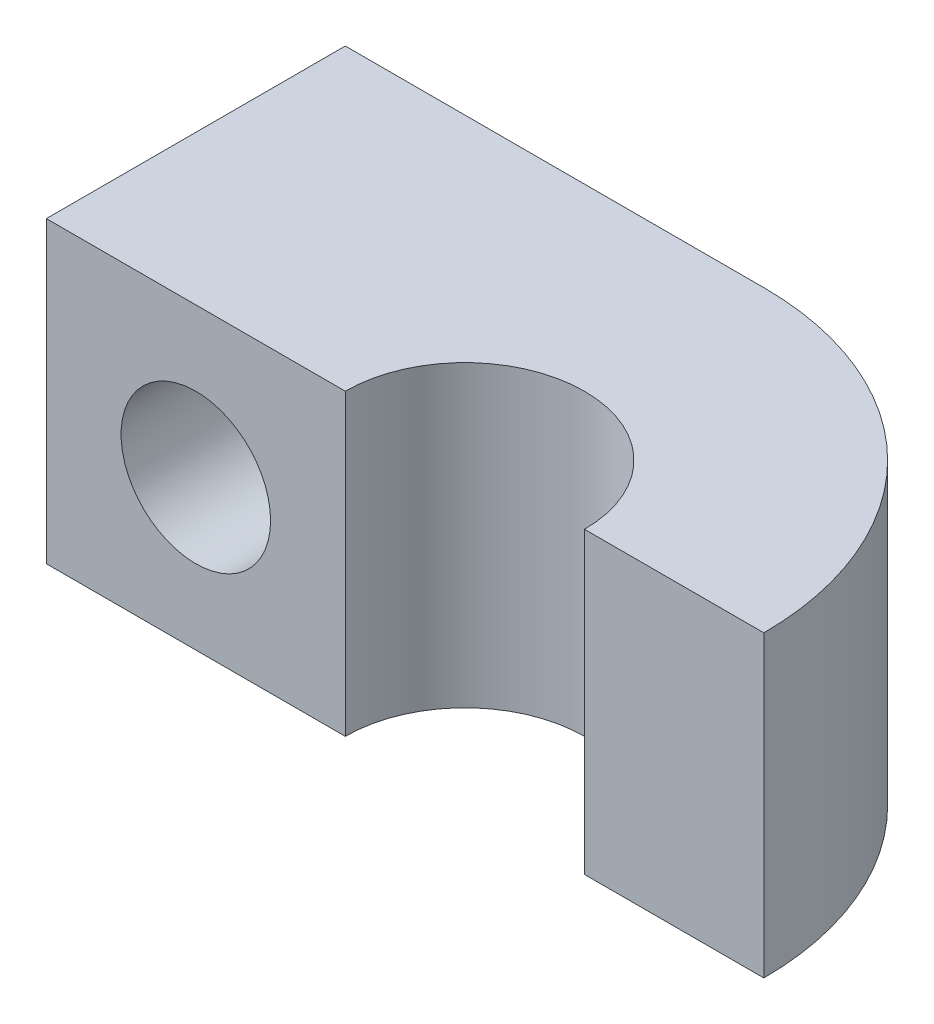
ISO-10303-21;
HEADER;
FILE_DESCRIPTION(('STEP AP214'),'2;1');
FILE_NAME('part.step','',(''),(''),'','','');
FILE_SCHEMA(('AUTOMOTIVE_DESIGN { 1 0 10303 214 1 1 1 1 }'));
ENDSEC;
DATA;
#1=APPLICATION_CONTEXT('core data for automotive mechanical design processes');
#2=APPLICATION_PROTOCOL_DEFINITION('international standard','automotive_design',2000,#1);
#3=PRODUCT_CONTEXT('',#1,'mechanical');
#4=PRODUCT('Part','Part','',(#3));
#5=PRODUCT_RELATED_PRODUCT_CATEGORY('part','',(#4));
#6=PRODUCT_DEFINITION_FORMATION('','',#4);
#7=PRODUCT_DEFINITION_CONTEXT('part definition',#1,'design');
#8=PRODUCT_DEFINITION('design','',#6,#7);
#9=PRODUCT_DEFINITION_SHAPE('','',#8);
#10=(LENGTH_UNIT() NAMED_UNIT(*) SI_UNIT(.MILLI.,.METRE.));
#11=(NAMED_UNIT(*) PLANE_ANGLE_UNIT() SI_UNIT($,.RADIAN.));
#12=(NAMED_UNIT(*) SI_UNIT($,.STERADIAN.) SOLID_ANGLE_UNIT());
#13=UNCERTAINTY_MEASURE_WITH_UNIT(LENGTH_MEASURE(1.E-05),#10,'distance_accuracy_value','');
#14=(GEOMETRIC_REPRESENTATION_CONTEXT(3) GLOBAL_UNCERTAINTY_ASSIGNED_CONTEXT((#13)) GLOBAL_UNIT_ASSIGNED_CONTEXT((#10,
#11,#12)) REPRESENTATION_CONTEXT('',''));
#15=CARTESIAN_POINT('',(0.,0.,0.));
#16=DIRECTION('',(0.,0.,1.));
#17=DIRECTION('',(1.,0.,0.));
#18=AXIS2_PLACEMENT_3D('',#15,#16,#17);
#19=CARTESIAN_POINT('',(0.,5.,0.));
#20=DIRECTION('',(0.,-1.,0.));
#21=DIRECTION('',(0.,0.,-1.));
#22=AXIS2_PLACEMENT_3D('',#19,#20,#21);
#23=CYLINDRICAL_SURFACE('',#22,2.);
#24=CARTESIAN_POINT('',(0.,0.,0.));
#25=DIRECTION('',(0.,-1.,0.));
#26=DIRECTION('',(0.,0.,1.));
#27=AXIS2_PLACEMENT_3D('',#24,#25,#26);
#28=CIRCLE('',#27,2.);
#29=CARTESIAN_POINT('',(-2.,0.,0.));
#30=VERTEX_POINT('',#29);
#31=CARTESIAN_POINT('',(2.,0.,0.));
#32=VERTEX_POINT('',#31);
#33=EDGE_CURVE('E125',#30,#32,#28,.T.);
#34=ORIENTED_EDGE('',*,*,#33,.T.);
#35=DIRECTION('',(0.,-1.,0.));
#36=VECTOR('',#35,1.);
#37=CARTESIAN_POINT('',(2.,5.,0.));
#38=LINE('',#37,#36);
#39=CARTESIAN_POINT('',(2.,5.,0.));
#40=VERTEX_POINT('',#39);
#41=EDGE_CURVE('E11',#40,#32,#38,.T.);
#42=ORIENTED_EDGE('',*,*,#41,.F.);
#43=CARTESIAN_POINT('',(0.,5.,0.));
#44=DIRECTION('',(0.,-1.,0.));
#45=DIRECTION('',(0.,0.,1.));
#46=AXIS2_PLACEMENT_3D('',#43,#44,#45);
#47=CIRCLE('',#46,2.);
#48=CARTESIAN_POINT('',(-2.,5.,0.));
#49=VERTEX_POINT('',#48);
#50=EDGE_CURVE('E136',#49,#40,#47,.T.);
#51=ORIENTED_EDGE('',*,*,#50,.F.);
#52=DIRECTION('',(0.,-1.,0.));
#53=VECTOR('',#52,1.);
#54=CARTESIAN_POINT('',(-2.,5.,0.));
#55=LINE('',#54,#53);
#56=EDGE_CURVE('E121',#49,#30,#55,.T.);
#57=ORIENTED_EDGE('',*,*,#56,.T.);
#58=EDGE_LOOP('',(#34,#42,#51,#57));
#59=FACE_BOUND('',#58,.T.);
#60=ADVANCED_FACE('F41',(#59),#23,.F.);
#61=CARTESIAN_POINT('',(2.,5.,0.));
#62=DIRECTION('',(0.,0.,-1.));
#63=DIRECTION('',(-1.,0.,0.));
#64=AXIS2_PLACEMENT_3D('',#61,#62,#63);
#65=PLANE('',#64);
#66=DIRECTION('',(1.,0.,0.));
#67=VECTOR('',#66,1.);
#68=CARTESIAN_POINT('',(2.,0.,0.));
#69=LINE('',#68,#67);
#70=CARTESIAN_POINT('',(5.,0.,0.));
#71=VERTEX_POINT('',#70);
#72=EDGE_CURVE('E128',#32,#71,#69,.T.);
#73=ORIENTED_EDGE('',*,*,#72,.T.);
#74=DIRECTION('',(0.,-1.,0.));
#75=VECTOR('',#74,1.);
#76=CARTESIAN_POINT('',(5.,5.,0.));
#77=LINE('',#76,#75);
#78=CARTESIAN_POINT('',(5.,5.,0.));
#79=VERTEX_POINT('',#78);
#80=EDGE_CURVE('E49',#79,#71,#77,.T.);
#81=ORIENTED_EDGE('',*,*,#80,.F.);
#82=DIRECTION('',(1.,0.,0.));
#83=VECTOR('',#82,1.);
#84=CARTESIAN_POINT('',(2.,5.,0.));
#85=LINE('',#84,#83);
#86=EDGE_CURVE('E94',#40,#79,#85,.T.);
#87=ORIENTED_EDGE('',*,*,#86,.F.);
#88=ORIENTED_EDGE('',*,*,#41,.T.);
#89=EDGE_LOOP('',(#73,#81,#87,#88));
#90=FACE_BOUND('',#89,.T.);
#91=ADVANCED_FACE('F164',(#90),#65,.F.);
#92=CARTESIAN_POINT('',(0.,5.,0.));
#93=DIRECTION('',(0.,-1.,0.));
#94=DIRECTION('',(0.,0.,-1.));
#95=AXIS2_PLACEMENT_3D('',#92,#93,#94);
#96=CYLINDRICAL_SURFACE('',#95,5.);
#97=CARTESIAN_POINT('',(0.,0.,0.));
#98=DIRECTION('',(0.,1.,0.));
#99=DIRECTION('',(0.,0.,1.));
#100=AXIS2_PLACEMENT_3D('',#97,#98,#99);
#101=CIRCLE('',#100,5.);
#102=CARTESIAN_POINT('',(0.,0.,-5.));
#103=VERTEX_POINT('',#102);
#104=EDGE_CURVE('E131',#71,#103,#101,.T.);
#105=ORIENTED_EDGE('',*,*,#104,.T.);
#106=DIRECTION('',(0.,-1.,0.));
#107=VECTOR('',#106,1.);
#108=CARTESIAN_POINT('',(0.,5.,-5.));
#109=LINE('',#108,#107);
#110=CARTESIAN_POINT('',(0.,5.,-5.));
#111=VERTEX_POINT('',#110);
#112=EDGE_CURVE('E116',#111,#103,#109,.T.);
#113=ORIENTED_EDGE('',*,*,#112,.F.);
#114=CARTESIAN_POINT('',(0.,5.,0.));
#115=DIRECTION('',(0.,1.,0.));
#116=DIRECTION('',(0.,0.,1.));
#117=AXIS2_PLACEMENT_3D('',#114,#115,#116);
#118=CIRCLE('',#117,5.);
#119=EDGE_CURVE('E107',#79,#111,#118,.T.);
#120=ORIENTED_EDGE('',*,*,#119,.F.);
#121=ORIENTED_EDGE('',*,*,#80,.T.);
#122=EDGE_LOOP('',(#105,#113,#120,#121));
#123=FACE_BOUND('',#122,.T.);
#124=ADVANCED_FACE('F142',(#123),#96,.T.);
#125=CARTESIAN_POINT('',(-7.,5.,-5.));
#126=DIRECTION('',(0.,0.,1.));
#127=DIRECTION('',(1.,0.,0.));
#128=AXIS2_PLACEMENT_3D('',#125,#126,#127);
#129=PLANE('',#128);
#130=CARTESIAN_POINT('',(-4.5,2.5,-5.));
#131=DIRECTION('',(0.,0.,1.));
#132=DIRECTION('',(1.,0.,0.));
#133=AXIS2_PLACEMENT_3D('',#130,#131,#132);
#134=CIRCLE('',#133,1.25);
#135=CARTESIAN_POINT('',(-3.25,2.5,-5.));
#136=VERTEX_POINT('',#135);
#137=EDGE_CURVE('E129',#136,#136,#134,.T.);
#138=ORIENTED_EDGE('',*,*,#137,.T.);
#139=EDGE_LOOP('',(#138));
#140=FACE_BOUND('',#139,.T.);
#141=DIRECTION('',(-1.,0.,0.));
#142=VECTOR('',#141,1.);
#143=CARTESIAN_POINT('',(-7.,0.,-5.));
#144=LINE('',#143,#142);
#145=CARTESIAN_POINT('',(-7.,0.,-5.));
#146=VERTEX_POINT('',#145);
#147=EDGE_CURVE('E115',#103,#146,#144,.T.);
#148=ORIENTED_EDGE('',*,*,#147,.T.);
#149=DIRECTION('',(0.,-1.,0.));
#150=VECTOR('',#149,1.);
#151=CARTESIAN_POINT('',(-7.,5.,-5.));
#152=LINE('',#151,#150);
#153=CARTESIAN_POINT('',(-7.,5.,-5.));
#154=VERTEX_POINT('',#153);
#155=EDGE_CURVE('E112',#154,#146,#152,.T.);
#156=ORIENTED_EDGE('',*,*,#155,.F.);
#157=DIRECTION('',(-1.,0.,0.));
#158=VECTOR('',#157,1.);
#159=CARTESIAN_POINT('',(-7.,5.,-5.));
#160=LINE('',#159,#158);
#161=EDGE_CURVE('E101',#111,#154,#160,.T.);
#162=ORIENTED_EDGE('',*,*,#161,.F.);
#163=ORIENTED_EDGE('',*,*,#112,.T.);
#164=EDGE_LOOP('',(#148,#156,#162,#163));
#165=FACE_BOUND('',#164,.T.);
#166=ADVANCED_FACE('F113',(#140,#165),#129,.F.);
#167=CARTESIAN_POINT('',(-7.,5.,0.));
#168=DIRECTION('',(1.,0.,0.));
#169=DIRECTION('',(0.,0.,-1.));
#170=AXIS2_PLACEMENT_3D('',#167,#168,#169);
#171=PLANE('',#170);
#172=DIRECTION('',(0.,0.,1.));
#173=VECTOR('',#172,1.);
#174=CARTESIAN_POINT('',(-7.,0.,0.));
#175=LINE('',#174,#173);
#176=CARTESIAN_POINT('',(-7.,0.,0.));
#177=VERTEX_POINT('',#176);
#178=EDGE_CURVE('E80',#146,#177,#175,.T.);
#179=ORIENTED_EDGE('',*,*,#178,.T.);
#180=DIRECTION('',(0.,-1.,0.));
#181=VECTOR('',#180,1.);
#182=CARTESIAN_POINT('',(-7.,5.,0.));
#183=LINE('',#182,#181);
#184=CARTESIAN_POINT('',(-7.,5.,0.));
#185=VERTEX_POINT('',#184);
#186=EDGE_CURVE('E117',#185,#177,#183,.T.);
#187=ORIENTED_EDGE('',*,*,#186,.F.);
#188=DIRECTION('',(0.,0.,1.));
#189=VECTOR('',#188,1.);
#190=CARTESIAN_POINT('',(-7.,5.,0.));
#191=LINE('',#190,#189);
#192=EDGE_CURVE('E105',#154,#185,#191,.T.);
#193=ORIENTED_EDGE('',*,*,#192,.F.);
#194=ORIENTED_EDGE('',*,*,#155,.T.);
#195=EDGE_LOOP('',(#179,#187,#193,#194));
#196=FACE_BOUND('',#195,.T.);
#197=ADVANCED_FACE('F119',(#196),#171,.F.);
#198=CARTESIAN_POINT('',(-2.,5.,0.));
#199=DIRECTION('',(0.,0.,-1.));
#200=DIRECTION('',(-1.,0.,0.));
#201=AXIS2_PLACEMENT_3D('',#198,#199,#200);
#202=PLANE('',#201);
#203=CARTESIAN_POINT('',(-4.5,2.5,0.));
#204=DIRECTION('',(0.,0.,1.));
#205=DIRECTION('',(1.,0.,0.));
#206=AXIS2_PLACEMENT_3D('',#203,#204,#205);
#207=CIRCLE('',#206,1.25);
#208=CARTESIAN_POINT('',(-3.25,2.5,0.));
#209=VERTEX_POINT('',#208);
#210=EDGE_CURVE('E180',#209,#209,#207,.T.);
#211=ORIENTED_EDGE('',*,*,#210,.F.);
#212=EDGE_LOOP('',(#211));
#213=FACE_BOUND('',#212,.T.);
#214=DIRECTION('',(1.,0.,0.));
#215=VECTOR('',#214,1.);
#216=CARTESIAN_POINT('',(-2.,0.,0.));
#217=LINE('',#216,#215);
#218=EDGE_CURVE('E86',#177,#30,#217,.T.);
#219=ORIENTED_EDGE('',*,*,#218,.T.);
#220=ORIENTED_EDGE('',*,*,#56,.F.);
#221=DIRECTION('',(1.,0.,0.));
#222=VECTOR('',#221,1.);
#223=CARTESIAN_POINT('',(-2.,5.,0.));
#224=LINE('',#223,#222);
#225=EDGE_CURVE('E57',#185,#49,#224,.T.);
#226=ORIENTED_EDGE('',*,*,#225,.F.);
#227=ORIENTED_EDGE('',*,*,#186,.T.);
#228=EDGE_LOOP('',(#219,#220,#226,#227));
#229=FACE_BOUND('',#228,.T.);
#230=ADVANCED_FACE('F149',(#213,#229),#202,.F.);
#231=CARTESIAN_POINT('',(0.,5.,0.));
#232=DIRECTION('',(0.,1.,0.));
#233=DIRECTION('',(0.,0.,1.));
#234=AXIS2_PLACEMENT_3D('',#231,#232,#233);
#235=PLANE('',#234);
#236=ORIENTED_EDGE('',*,*,#50,.T.);
#237=ORIENTED_EDGE('',*,*,#86,.T.);
#238=ORIENTED_EDGE('',*,*,#119,.T.);
#239=ORIENTED_EDGE('',*,*,#161,.T.);
#240=ORIENTED_EDGE('',*,*,#192,.T.);
#241=ORIENTED_EDGE('',*,*,#225,.T.);
#242=EDGE_LOOP('',(#236,#237,#238,#239,#240,#241));
#243=FACE_BOUND('',#242,.T.);
#244=ADVANCED_FACE('F103',(#243),#235,.T.);
#245=CARTESIAN_POINT('',(0.,0.,0.));
#246=DIRECTION('',(0.,1.,0.));
#247=DIRECTION('',(0.,0.,1.));
#248=AXIS2_PLACEMENT_3D('',#245,#246,#247);
#249=PLANE('',#248);
#250=ORIENTED_EDGE('',*,*,#33,.F.);
#251=ORIENTED_EDGE('',*,*,#218,.F.);
#252=ORIENTED_EDGE('',*,*,#178,.F.);
#253=ORIENTED_EDGE('',*,*,#147,.F.);
#254=ORIENTED_EDGE('',*,*,#104,.F.);
#255=ORIENTED_EDGE('',*,*,#72,.F.);
#256=EDGE_LOOP('',(#250,#251,#252,#253,#254,#255));
#257=FACE_BOUND('',#256,.T.);
#258=ADVANCED_FACE('F145',(#257),#249,.F.);
#259=CARTESIAN_POINT('',(-4.5,2.5,-5.));
#260=DIRECTION('',(0.,0.,1.));
#261=DIRECTION('',(1.,0.,0.));
#262=AXIS2_PLACEMENT_3D('',#259,#260,#261);
#263=CYLINDRICAL_SURFACE('',#262,1.25);
#264=ORIENTED_EDGE('',*,*,#137,.F.);
#265=EDGE_LOOP('',(#264));
#266=FACE_BOUND('',#265,.T.);
#267=ORIENTED_EDGE('',*,*,#210,.T.);
#268=EDGE_LOOP('',(#267));
#269=FACE_BOUND('',#268,.T.);
#270=ADVANCED_FACE('F187',(#266,#269),#263,.F.);
#271=CLOSED_SHELL('',(#60,#91,#124,#166,#197,#230,#244,#258,#270));
#272=MANIFOLD_SOLID_BREP('B2',#271);
#273=ADVANCED_BREP_SHAPE_REPRESENTATION('',(#18,#272),#14);
#274=SHAPE_DEFINITION_REPRESENTATION(#9,#273);
ENDSEC;
END-ISO-10303-21;
